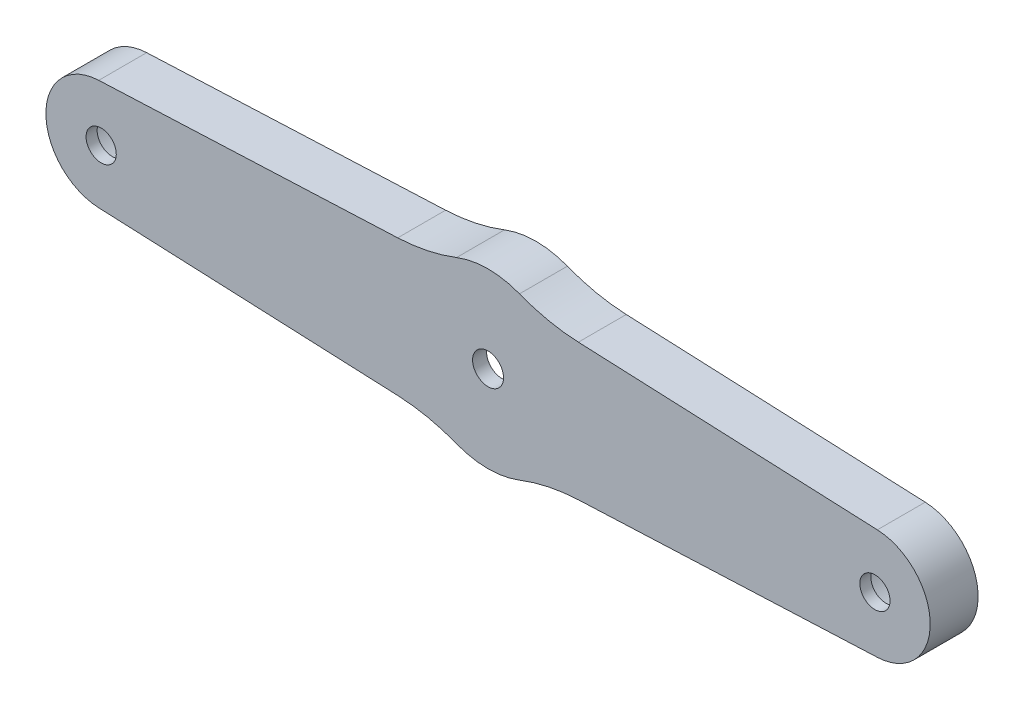
ISO-10303-21;
HEADER;
FILE_DESCRIPTION(('STEP AP214'),'2;1');
FILE_NAME('part.step','',(''),(''),'','','');
FILE_SCHEMA(('AUTOMOTIVE_DESIGN { 1 0 10303 214 1 1 1 1 }'));
ENDSEC;
DATA;
#1=APPLICATION_CONTEXT('core data for automotive mechanical design processes');
#2=APPLICATION_PROTOCOL_DEFINITION('international standard','automotive_design',2000,#1);
#3=PRODUCT_CONTEXT('',#1,'mechanical');
#4=PRODUCT('Part','Part','',(#3));
#5=PRODUCT_RELATED_PRODUCT_CATEGORY('part','',(#4));
#6=PRODUCT_DEFINITION_FORMATION('','',#4);
#7=PRODUCT_DEFINITION_CONTEXT('part definition',#1,'design');
#8=PRODUCT_DEFINITION('design','',#6,#7);
#9=PRODUCT_DEFINITION_SHAPE('','',#8);
#10=(LENGTH_UNIT() NAMED_UNIT(*) SI_UNIT(.MILLI.,.METRE.));
#11=(NAMED_UNIT(*) PLANE_ANGLE_UNIT() SI_UNIT($,.RADIAN.));
#12=(NAMED_UNIT(*) SI_UNIT($,.STERADIAN.) SOLID_ANGLE_UNIT());
#13=UNCERTAINTY_MEASURE_WITH_UNIT(LENGTH_MEASURE(1.E-05),#10,'distance_accuracy_value','');
#14=(GEOMETRIC_REPRESENTATION_CONTEXT(3) GLOBAL_UNCERTAINTY_ASSIGNED_CONTEXT((#13)) GLOBAL_UNIT_ASSIGNED_CONTEXT((#10,
#11,#12)) REPRESENTATION_CONTEXT('',''));
#15=CARTESIAN_POINT('',(0.,0.,0.));
#16=DIRECTION('',(0.,0.,1.));
#17=DIRECTION('',(1.,0.,0.));
#18=AXIS2_PLACEMENT_3D('',#15,#16,#17);
#19=CARTESIAN_POINT('',(0.,29.,52.5));
#20=DIRECTION('',(0.,0.,1.));
#21=DIRECTION('',(1.,0.,0.));
#22=AXIS2_PLACEMENT_3D('',#19,#20,#21);
#23=CYLINDRICAL_SURFACE('',#22,20.);
#24=CARTESIAN_POINT('',(0.,29.,61.7));
#25=DIRECTION('',(0.,0.,1.));
#26=DIRECTION('',(1.,0.,0.));
#27=AXIS2_PLACEMENT_3D('',#24,#25,#26);
#28=CIRCLE('',#27,20.);
#29=CARTESIAN_POINT('',(20.,29.,61.7));
#30=VERTEX_POINT('',#29);
#31=EDGE_CURVE('E206',#30,#30,#28,.F.);
#32=ORIENTED_EDGE('',*,*,#31,.F.);
#33=EDGE_LOOP('',(#32));
#34=FACE_BOUND('',#33,.T.);
#35=CARTESIAN_POINT('',(0.,29.,52.5));
#36=DIRECTION('',(0.,0.,1.));
#37=DIRECTION('',(1.,0.,0.));
#38=AXIS2_PLACEMENT_3D('',#35,#36,#37);
#39=CIRCLE('',#38,20.);
#40=CARTESIAN_POINT('',(20.,29.,52.5));
#41=VERTEX_POINT('',#40);
#42=EDGE_CURVE('E19',#41,#41,#39,.F.);
#43=ORIENTED_EDGE('',*,*,#42,.T.);
#44=EDGE_LOOP('',(#43));
#45=FACE_BOUND('',#44,.T.);
#46=ADVANCED_FACE('F16',(#34,#45),#23,.F.);
#47=CARTESIAN_POINT('',(-105.,29.,52.5));
#48=DIRECTION('',(0.,0.,1.));
#49=DIRECTION('',(1.,0.,0.));
#50=AXIS2_PLACEMENT_3D('',#47,#48,#49);
#51=CYLINDRICAL_SURFACE('',#50,12.);
#52=CARTESIAN_POINT('',(-105.,29.,62.5));
#53=DIRECTION('',(0.,0.,1.));
#54=DIRECTION('',(1.,0.,0.));
#55=AXIS2_PLACEMENT_3D('',#52,#53,#54);
#56=CIRCLE('',#55,12.);
#57=CARTESIAN_POINT('',(-93.,29.,62.5));
#58=VERTEX_POINT('',#57);
#59=EDGE_CURVE('E203',#58,#58,#56,.F.);
#60=ORIENTED_EDGE('',*,*,#59,.F.);
#61=EDGE_LOOP('',(#60));
#62=FACE_BOUND('',#61,.T.);
#63=CARTESIAN_POINT('',(-105.,29.,52.5));
#64=DIRECTION('',(0.,0.,1.));
#65=DIRECTION('',(1.,0.,0.));
#66=AXIS2_PLACEMENT_3D('',#63,#64,#65);
#67=CIRCLE('',#66,12.);
#68=CARTESIAN_POINT('',(-93.,29.,52.5));
#69=VERTEX_POINT('',#68);
#70=EDGE_CURVE('E211',#69,#69,#67,.F.);
#71=ORIENTED_EDGE('',*,*,#70,.T.);
#72=EDGE_LOOP('',(#71));
#73=FACE_BOUND('',#72,.T.);
#74=ADVANCED_FACE('F232',(#62,#73),#51,.F.);
#75=CARTESIAN_POINT('',(105.,29.,52.5));
#76=DIRECTION('',(0.,0.,1.));
#77=DIRECTION('',(1.,0.,0.));
#78=AXIS2_PLACEMENT_3D('',#75,#76,#77);
#79=CYLINDRICAL_SURFACE('',#78,12.);
#80=CARTESIAN_POINT('',(105.,29.,62.5));
#81=DIRECTION('',(0.,0.,1.));
#82=DIRECTION('',(1.,0.,0.));
#83=AXIS2_PLACEMENT_3D('',#80,#81,#82);
#84=CIRCLE('',#83,12.);
#85=CARTESIAN_POINT('',(117.,29.,62.5));
#86=VERTEX_POINT('',#85);
#87=EDGE_CURVE('E114',#86,#86,#84,.F.);
#88=ORIENTED_EDGE('',*,*,#87,.F.);
#89=EDGE_LOOP('',(#88));
#90=FACE_BOUND('',#89,.T.);
#91=CARTESIAN_POINT('',(105.,29.,52.5));
#92=DIRECTION('',(0.,0.,1.));
#93=DIRECTION('',(1.,0.,0.));
#94=AXIS2_PLACEMENT_3D('',#91,#92,#93);
#95=CIRCLE('',#94,12.);
#96=CARTESIAN_POINT('',(117.,29.,52.5));
#97=VERTEX_POINT('',#96);
#98=EDGE_CURVE('E209',#97,#97,#95,.F.);
#99=ORIENTED_EDGE('',*,*,#98,.T.);
#100=EDGE_LOOP('',(#99));
#101=FACE_BOUND('',#100,.T.);
#102=ADVANCED_FACE('F221',(#90,#101),#79,.F.);
#103=CARTESIAN_POINT('',(0.,29.0000000000001,52.5));
#104=DIRECTION('',(0.,0.,1.));
#105=DIRECTION('',(1.,0.,0.));
#106=AXIS2_PLACEMENT_3D('',#103,#104,#105);
#107=PLANE('',#106);
#108=ORIENTED_EDGE('',*,*,#98,.F.);
#109=EDGE_LOOP('',(#108));
#110=FACE_BOUND('',#109,.T.);
#111=ORIENTED_EDGE('',*,*,#70,.F.);
#112=EDGE_LOOP('',(#111));
#113=FACE_BOUND('',#112,.T.);
#114=ORIENTED_EDGE('',*,*,#42,.F.);
#115=EDGE_LOOP('',(#114));
#116=FACE_BOUND('',#115,.T.);
#117=DIRECTION('',(0.999048221581858,0.0436193873653249,0.));
#118=VECTOR('',#117,1.);
#119=CARTESIAN_POINT('',(13.8367845227035,10.0054377762405,52.5));
#120=LINE('',#119,#118);
#121=CARTESIAN_POINT('',(24.5141938105712,10.4716235335688,52.5));
#122=VERTEX_POINT('',#121);
#123=CARTESIAN_POINT('',(105.65429081048,14.014276676272,52.5));
#124=VERTEX_POINT('',#123);
#125=EDGE_CURVE('E108',#122,#124,#120,.T.);
#126=ORIENTED_EDGE('',*,*,#125,.F.);
#127=CARTESIAN_POINT('',(26.6951631788374,-39.4807875455241,52.5));
#128=DIRECTION('',(0.,0.,1.));
#129=DIRECTION('',(1.,0.,0.));
#130=AXIS2_PLACEMENT_3D('',#127,#128,#129);
#131=CIRCLE('',#130,50.);
#132=CARTESIAN_POINT('',(8.5351882272473,7.10478221333597,52.5));
#133=VERTEX_POINT('',#132);
#134=EDGE_CURVE('E127',#122,#133,#131,.T.);
#135=ORIENTED_EDGE('',*,*,#134,.T.);
#136=CARTESIAN_POINT('',(0.,29.,52.5));
#137=DIRECTION('',(0.,0.,1.));
#138=DIRECTION('',(1.,0.,0.));
#139=AXIS2_PLACEMENT_3D('',#136,#137,#138);
#140=CIRCLE('',#139,23.4999999999998);
#141=CARTESIAN_POINT('',(-8.53518822724746,7.10478221333603,52.5));
#142=VERTEX_POINT('',#141);
#143=EDGE_CURVE('E184',#142,#133,#140,.T.);
#144=ORIENTED_EDGE('',*,*,#143,.F.);
#145=CARTESIAN_POINT('',(-26.695163178838,-39.4807875455239,52.5));
#146=DIRECTION('',(0.,0.,1.));
#147=DIRECTION('',(1.,0.,0.));
#148=AXIS2_PLACEMENT_3D('',#145,#146,#147);
#149=CIRCLE('',#148,50.);
#150=CARTESIAN_POINT('',(-24.5141938105718,10.471623533569,52.5));
#151=VERTEX_POINT('',#150);
#152=EDGE_CURVE('E187',#142,#151,#149,.T.);
#153=ORIENTED_EDGE('',*,*,#152,.T.);
#154=DIRECTION('',(0.999048221581858,-0.0436193873653238,0.));
#155=VECTOR('',#154,1.);
#156=CARTESIAN_POINT('',(-105.65429081048,14.0142766762721,52.5));
#157=LINE('',#156,#155);
#158=CARTESIAN_POINT('',(-105.65429081048,14.0142766762721,52.5));
#159=VERTEX_POINT('',#158);
#160=EDGE_CURVE('E132',#159,#151,#157,.T.);
#161=ORIENTED_EDGE('',*,*,#160,.F.);
#162=CARTESIAN_POINT('',(-105.,29.,52.5));
#163=DIRECTION('',(0.,0.,1.));
#164=DIRECTION('',(1.,0.,0.));
#165=AXIS2_PLACEMENT_3D('',#162,#163,#164);
#166=CIRCLE('',#165,15.);
#167=CARTESIAN_POINT('',(-105.65429081048,43.9857233237278,52.5));
#168=VERTEX_POINT('',#167);
#169=EDGE_CURVE('E139',#168,#159,#166,.T.);
#170=ORIENTED_EDGE('',*,*,#169,.F.);
#171=DIRECTION('',(-0.999048221581857,-0.043619387365342,0.));
#172=VECTOR('',#171,1.);
#173=CARTESIAN_POINT('',(-13.8367845227016,47.994562223761,52.5));
#174=LINE('',#173,#172);
#175=CARTESIAN_POINT('',(-24.5141938105673,47.5283764664326,52.5));
#176=VERTEX_POINT('',#175);
#177=EDGE_CURVE('E136',#176,#168,#174,.T.);
#178=ORIENTED_EDGE('',*,*,#177,.F.);
#179=CARTESIAN_POINT('',(-26.6951631788344,97.4807875455255,52.5));
#180=DIRECTION('',(0.,0.,1.));
#181=DIRECTION('',(1.,0.,0.));
#182=AXIS2_PLACEMENT_3D('',#179,#180,#181);
#183=CIRCLE('',#182,50.);
#184=CARTESIAN_POINT('',(-8.53518822724637,50.8952177866646,52.5));
#185=VERTEX_POINT('',#184);
#186=EDGE_CURVE('E192',#176,#185,#183,.T.);
#187=ORIENTED_EDGE('',*,*,#186,.T.);
#188=CARTESIAN_POINT('',(0.,29.,52.5));
#189=DIRECTION('',(0.,0.,1.));
#190=DIRECTION('',(1.,0.,0.));
#191=AXIS2_PLACEMENT_3D('',#188,#189,#190);
#192=CIRCLE('',#191,23.5);
#193=CARTESIAN_POINT('',(8.53518822724646,50.8952177866646,52.5));
#194=VERTEX_POINT('',#193);
#195=EDGE_CURVE('E196',#194,#185,#192,.T.);
#196=ORIENTED_EDGE('',*,*,#195,.F.);
#197=CARTESIAN_POINT('',(26.6951631788346,97.4807875455255,52.5));
#198=DIRECTION('',(0.,0.,1.));
#199=DIRECTION('',(1.,0.,0.));
#200=AXIS2_PLACEMENT_3D('',#197,#198,#199);
#201=CIRCLE('',#200,50.);
#202=CARTESIAN_POINT('',(24.5141938105676,47.5283764664326,52.5));
#203=VERTEX_POINT('',#202);
#204=EDGE_CURVE('E199',#194,#203,#201,.T.);
#205=ORIENTED_EDGE('',*,*,#204,.T.);
#206=DIRECTION('',(-0.999048221581858,0.0436193873653404,0.));
#207=VECTOR('',#206,1.);
#208=CARTESIAN_POINT('',(105.65429081048,43.9857233237279,52.5));
#209=LINE('',#208,#207);
#210=CARTESIAN_POINT('',(105.65429081048,43.9857233237279,52.5));
#211=VERTEX_POINT('',#210);
#212=EDGE_CURVE('E110',#211,#203,#209,.T.);
#213=ORIENTED_EDGE('',*,*,#212,.F.);
#214=CARTESIAN_POINT('',(105.,29.,52.5));
#215=DIRECTION('',(0.,0.,1.));
#216=DIRECTION('',(1.,0.,0.));
#217=AXIS2_PLACEMENT_3D('',#214,#215,#216);
#218=CIRCLE('',#217,15.0000000000001);
#219=EDGE_CURVE('E103',#124,#211,#218,.T.);
#220=ORIENTED_EDGE('',*,*,#219,.F.);
#221=EDGE_LOOP('',(#126,#135,#144,#153,#161,#170,#178,#187,#196,#205,#213,#220));
#222=FACE_BOUND('',#221,.T.);
#223=ADVANCED_FACE('F105',(#110,#113,#116,#222),#107,.F.);
#224=CARTESIAN_POINT('',(0.,29.,61.7));
#225=DIRECTION('',(0.,0.,-1.));
#226=DIRECTION('',(-1.,0.,0.));
#227=AXIS2_PLACEMENT_3D('',#224,#225,#226);
#228=PLANE('',#227);
#229=CARTESIAN_POINT('',(0.,29.,61.7));
#230=DIRECTION('',(0.,0.,-1.));
#231=DIRECTION('',(-1.,0.,0.));
#232=AXIS2_PLACEMENT_3D('',#229,#230,#231);
#233=CIRCLE('',#232,4.2);
#234=CARTESIAN_POINT('',(-4.19999999999998,29.,61.7));
#235=VERTEX_POINT('',#234);
#236=EDGE_CURVE('E123',#235,#235,#233,.F.);
#237=ORIENTED_EDGE('',*,*,#236,.T.);
#238=EDGE_LOOP('',(#237));
#239=FACE_BOUND('',#238,.T.);
#240=ORIENTED_EDGE('',*,*,#31,.T.);
#241=EDGE_LOOP('',(#240));
#242=FACE_BOUND('',#241,.T.);
#243=ADVANCED_FACE('F220',(#239,#242),#228,.T.);
#244=CARTESIAN_POINT('',(-105.,29.,62.5));
#245=DIRECTION('',(0.,0.,-1.));
#246=DIRECTION('',(-1.,0.,0.));
#247=AXIS2_PLACEMENT_3D('',#244,#245,#246);
#248=PLANE('',#247);
#249=CARTESIAN_POINT('',(-105.,29.,62.5));
#250=DIRECTION('',(0.,0.,-1.));
#251=DIRECTION('',(0.,1.,0.));
#252=AXIS2_PLACEMENT_3D('',#249,#250,#251);
#253=CIRCLE('',#252,4.1);
#254=CARTESIAN_POINT('',(-105.,33.1,62.5));
#255=VERTEX_POINT('',#254);
#256=EDGE_CURVE('E177',#255,#255,#253,.F.);
#257=ORIENTED_EDGE('',*,*,#256,.T.);
#258=EDGE_LOOP('',(#257));
#259=FACE_BOUND('',#258,.T.);
#260=ORIENTED_EDGE('',*,*,#59,.T.);
#261=EDGE_LOOP('',(#260));
#262=FACE_BOUND('',#261,.T.);
#263=ADVANCED_FACE('F229',(#259,#262),#248,.T.);
#264=CARTESIAN_POINT('',(105.,29.,62.5));
#265=DIRECTION('',(0.,0.,-1.));
#266=DIRECTION('',(-1.,0.,0.));
#267=AXIS2_PLACEMENT_3D('',#264,#265,#266);
#268=PLANE('',#267);
#269=CARTESIAN_POINT('',(105.,29.,62.5));
#270=DIRECTION('',(0.,0.,-1.));
#271=DIRECTION('',(0.,1.,0.));
#272=AXIS2_PLACEMENT_3D('',#269,#270,#271);
#273=CIRCLE('',#272,4.1);
#274=CARTESIAN_POINT('',(105.,33.1,62.5));
#275=VERTEX_POINT('',#274);
#276=EDGE_CURVE('E174',#275,#275,#273,.F.);
#277=ORIENTED_EDGE('',*,*,#276,.T.);
#278=EDGE_LOOP('',(#277));
#279=FACE_BOUND('',#278,.T.);
#280=ORIENTED_EDGE('',*,*,#87,.T.);
#281=EDGE_LOOP('',(#280));
#282=FACE_BOUND('',#281,.T.);
#283=ADVANCED_FACE('F300',(#279,#282),#268,.T.);
#284=CARTESIAN_POINT('',(105.,29.,52.5));
#285=DIRECTION('',(0.,0.,1.));
#286=DIRECTION('',(1.,0.,0.));
#287=AXIS2_PLACEMENT_3D('',#284,#285,#286);
#288=CYLINDRICAL_SURFACE('',#287,15.0000000000001);
#289=CARTESIAN_POINT('',(105.,29.,65.5));
#290=DIRECTION('',(0.,0.,1.));
#291=DIRECTION('',(1.,0.,0.));
#292=AXIS2_PLACEMENT_3D('',#289,#290,#291);
#293=CIRCLE('',#292,15.0000000000001);
#294=CARTESIAN_POINT('',(105.65429081048,14.014276676272,65.5));
#295=VERTEX_POINT('',#294);
#296=CARTESIAN_POINT('',(105.65429081048,43.9857233237279,65.5));
#297=VERTEX_POINT('',#296);
#298=EDGE_CURVE('E120',#295,#297,#293,.T.);
#299=ORIENTED_EDGE('',*,*,#298,.F.);
#300=DIRECTION('',(0.,0.,1.));
#301=VECTOR('',#300,1.);
#302=CARTESIAN_POINT('',(105.65429081048,14.014276676272,52.5));
#303=LINE('',#302,#301);
#304=EDGE_CURVE('E117',#124,#295,#303,.T.);
#305=ORIENTED_EDGE('',*,*,#304,.F.);
#306=ORIENTED_EDGE('',*,*,#219,.T.);
#307=DIRECTION('',(0.,0.,1.));
#308=VECTOR('',#307,1.);
#309=CARTESIAN_POINT('',(105.65429081048,43.9857233237279,52.5));
#310=LINE('',#309,#308);
#311=EDGE_CURVE('E113',#297,#211,#310,.F.);
#312=ORIENTED_EDGE('',*,*,#311,.F.);
#313=EDGE_LOOP('',(#299,#305,#306,#312));
#314=FACE_BOUND('',#313,.T.);
#315=ADVANCED_FACE('F118',(#314),#288,.T.);
#316=CARTESIAN_POINT('',(105.65429081048,43.9857233237279,52.5));
#317=DIRECTION('',(0.0436193873653404,0.999048221581858,0.));
#318=DIRECTION('',(-0.999048221581858,0.0436193873653404,0.));
#319=AXIS2_PLACEMENT_3D('',#316,#317,#318);
#320=PLANE('',#319);
#321=ORIENTED_EDGE('',*,*,#311,.T.);
#322=ORIENTED_EDGE('',*,*,#212,.T.);
#323=DIRECTION('',(0.,0.,1.));
#324=VECTOR('',#323,1.);
#325=CARTESIAN_POINT('',(24.5141938105676,47.5283764664326,52.5));
#326=LINE('',#325,#324);
#327=CARTESIAN_POINT('',(24.5141938105676,47.5283764664326,65.5));
#328=VERTEX_POINT('',#327);
#329=EDGE_CURVE('E141',#203,#328,#326,.T.);
#330=ORIENTED_EDGE('',*,*,#329,.T.);
#331=DIRECTION('',(-0.999048221581858,0.0436193873653408,0.));
#332=VECTOR('',#331,1.);
#333=CARTESIAN_POINT('',(105.65429081048,43.9857233237279,65.5));
#334=LINE('',#333,#332);
#335=EDGE_CURVE('E172',#297,#328,#334,.T.);
#336=ORIENTED_EDGE('',*,*,#335,.F.);
#337=EDGE_LOOP('',(#321,#322,#330,#336));
#338=FACE_BOUND('',#337,.T.);
#339=ADVANCED_FACE('F293',(#338),#320,.T.);
#340=CARTESIAN_POINT('',(26.6951631788346,97.4807875455255,52.5));
#341=DIRECTION('',(0.,0.,1.));
#342=DIRECTION('',(1.,0.,0.));
#343=AXIS2_PLACEMENT_3D('',#340,#341,#342);
#344=CYLINDRICAL_SURFACE('',#343,50.);
#345=DIRECTION('',(0.,0.,1.));
#346=VECTOR('',#345,1.);
#347=CARTESIAN_POINT('',(8.53518822724646,50.8952177866646,52.5));
#348=LINE('',#347,#346);
#349=CARTESIAN_POINT('',(8.53518822724646,50.8952177866646,65.5));
#350=VERTEX_POINT('',#349);
#351=EDGE_CURVE('E198',#350,#194,#348,.F.);
#352=ORIENTED_EDGE('',*,*,#351,.F.);
#353=CARTESIAN_POINT('',(26.6951631788346,97.4807875455255,65.5));
#354=DIRECTION('',(0.,0.,1.));
#355=DIRECTION('',(1.,0.,0.));
#356=AXIS2_PLACEMENT_3D('',#353,#354,#355);
#357=CIRCLE('',#356,50.);
#358=EDGE_CURVE('E169',#328,#350,#357,.F.);
#359=ORIENTED_EDGE('',*,*,#358,.F.);
#360=ORIENTED_EDGE('',*,*,#329,.F.);
#361=ORIENTED_EDGE('',*,*,#204,.F.);
#362=EDGE_LOOP('',(#352,#359,#360,#361));
#363=FACE_BOUND('',#362,.T.);
#364=ADVANCED_FACE('F289',(#363),#344,.F.);
#365=CARTESIAN_POINT('',(0.,29.,52.5));
#366=DIRECTION('',(0.,0.,1.));
#367=DIRECTION('',(1.,0.,0.));
#368=AXIS2_PLACEMENT_3D('',#365,#366,#367);
#369=CYLINDRICAL_SURFACE('',#368,23.5);
#370=ORIENTED_EDGE('',*,*,#351,.T.);
#371=ORIENTED_EDGE('',*,*,#195,.T.);
#372=DIRECTION('',(0.,0.,1.));
#373=VECTOR('',#372,1.);
#374=CARTESIAN_POINT('',(-8.53518822724638,50.8952177866646,52.5));
#375=LINE('',#374,#373);
#376=CARTESIAN_POINT('',(-8.53518822724636,50.8952177866646,65.5));
#377=VERTEX_POINT('',#376);
#378=EDGE_CURVE('E195',#185,#377,#375,.T.);
#379=ORIENTED_EDGE('',*,*,#378,.T.);
#380=CARTESIAN_POINT('',(0.,29.,65.5));
#381=DIRECTION('',(0.,0.,1.));
#382=DIRECTION('',(1.,0.,0.));
#383=AXIS2_PLACEMENT_3D('',#380,#381,#382);
#384=CIRCLE('',#383,23.5);
#385=EDGE_CURVE('E166',#350,#377,#384,.T.);
#386=ORIENTED_EDGE('',*,*,#385,.F.);
#387=EDGE_LOOP('',(#370,#371,#379,#386));
#388=FACE_BOUND('',#387,.T.);
#389=ADVANCED_FACE('F285',(#388),#369,.T.);
#390=CARTESIAN_POINT('',(-26.6951631788344,97.4807875455255,52.5));
#391=DIRECTION('',(0.,0.,1.));
#392=DIRECTION('',(1.,0.,0.));
#393=AXIS2_PLACEMENT_3D('',#390,#391,#392);
#394=CYLINDRICAL_SURFACE('',#393,50.);
#395=DIRECTION('',(0.,0.,1.));
#396=VECTOR('',#395,1.);
#397=CARTESIAN_POINT('',(-24.5141938105673,47.5283764664326,52.5));
#398=LINE('',#397,#396);
#399=CARTESIAN_POINT('',(-24.5141938105673,47.5283764664327,65.5));
#400=VERTEX_POINT('',#399);
#401=EDGE_CURVE('E140',#400,#176,#398,.F.);
#402=ORIENTED_EDGE('',*,*,#401,.F.);
#403=CARTESIAN_POINT('',(-26.6951631788344,97.4807875455255,65.5));
#404=DIRECTION('',(0.,0.,1.));
#405=DIRECTION('',(1.,0.,0.));
#406=AXIS2_PLACEMENT_3D('',#403,#404,#405);
#407=CIRCLE('',#406,50.);
#408=EDGE_CURVE('E163',#377,#400,#407,.F.);
#409=ORIENTED_EDGE('',*,*,#408,.F.);
#410=ORIENTED_EDGE('',*,*,#378,.F.);
#411=ORIENTED_EDGE('',*,*,#186,.F.);
#412=EDGE_LOOP('',(#402,#409,#410,#411));
#413=FACE_BOUND('',#412,.T.);
#414=ADVANCED_FACE('F281',(#413),#394,.F.);
#415=CARTESIAN_POINT('',(-13.8367845227016,47.994562223761,52.5));
#416=DIRECTION('',(-0.043619387365342,0.999048221581857,0.));
#417=DIRECTION('',(-0.999048221581857,-0.043619387365342,0.));
#418=AXIS2_PLACEMENT_3D('',#415,#416,#417);
#419=PLANE('',#418);
#420=DIRECTION('',(0.,0.,1.));
#421=VECTOR('',#420,1.);
#422=CARTESIAN_POINT('',(-105.65429081048,43.9857233237279,52.5));
#423=LINE('',#422,#421);
#424=CARTESIAN_POINT('',(-105.65429081048,43.9857233237279,65.5));
#425=VERTEX_POINT('',#424);
#426=EDGE_CURVE('E191',#425,#168,#423,.F.);
#427=ORIENTED_EDGE('',*,*,#426,.F.);
#428=DIRECTION('',(-0.999048221581858,-0.0436193873653418,0.));
#429=VECTOR('',#428,1.);
#430=CARTESIAN_POINT('',(-24.5141938105673,47.5283764664327,65.5));
#431=LINE('',#430,#429);
#432=EDGE_CURVE('E162',#400,#425,#431,.T.);
#433=ORIENTED_EDGE('',*,*,#432,.F.);
#434=ORIENTED_EDGE('',*,*,#401,.T.);
#435=ORIENTED_EDGE('',*,*,#177,.T.);
#436=EDGE_LOOP('',(#427,#433,#434,#435));
#437=FACE_BOUND('',#436,.T.);
#438=ADVANCED_FACE('F277',(#437),#419,.T.);
#439=CARTESIAN_POINT('',(-105.,29.,52.5));
#440=DIRECTION('',(0.,0.,1.));
#441=DIRECTION('',(1.,0.,0.));
#442=AXIS2_PLACEMENT_3D('',#439,#440,#441);
#443=CYLINDRICAL_SURFACE('',#442,15.);
#444=CARTESIAN_POINT('',(-105.,29.,65.5));
#445=DIRECTION('',(0.,0.,1.));
#446=DIRECTION('',(1.,0.,0.));
#447=AXIS2_PLACEMENT_3D('',#444,#445,#446);
#448=CIRCLE('',#447,15.);
#449=CARTESIAN_POINT('',(-105.65429081048,14.0142766762721,65.5));
#450=VERTEX_POINT('',#449);
#451=EDGE_CURVE('E159',#425,#450,#448,.T.);
#452=ORIENTED_EDGE('',*,*,#451,.F.);
#453=ORIENTED_EDGE('',*,*,#426,.T.);
#454=ORIENTED_EDGE('',*,*,#169,.T.);
#455=DIRECTION('',(0.,0.,1.));
#456=VECTOR('',#455,1.);
#457=CARTESIAN_POINT('',(-105.65429081048,14.0142766762721,52.5));
#458=LINE('',#457,#456);
#459=EDGE_CURVE('E135',#450,#159,#458,.F.);
#460=ORIENTED_EDGE('',*,*,#459,.F.);
#461=EDGE_LOOP('',(#452,#453,#454,#460));
#462=FACE_BOUND('',#461,.T.);
#463=ADVANCED_FACE('F273',(#462),#443,.T.);
#464=CARTESIAN_POINT('',(-105.65429081048,14.0142766762721,52.5));
#465=DIRECTION('',(-0.0436193873653238,-0.999048221581858,0.));
#466=DIRECTION('',(0.999048221581858,-0.0436193873653238,0.));
#467=AXIS2_PLACEMENT_3D('',#464,#465,#466);
#468=PLANE('',#467);
#469=ORIENTED_EDGE('',*,*,#459,.T.);
#470=ORIENTED_EDGE('',*,*,#160,.T.);
#471=DIRECTION('',(0.,0.,1.));
#472=VECTOR('',#471,1.);
#473=CARTESIAN_POINT('',(-24.5141938105718,10.471623533569,52.5));
#474=LINE('',#473,#472);
#475=CARTESIAN_POINT('',(-24.5141938105718,10.471623533569,65.5));
#476=VERTEX_POINT('',#475);
#477=EDGE_CURVE('E134',#151,#476,#474,.T.);
#478=ORIENTED_EDGE('',*,*,#477,.T.);
#479=DIRECTION('',(0.999048221581858,-0.0436193873653234,0.));
#480=VECTOR('',#479,1.);
#481=CARTESIAN_POINT('',(-105.65429081048,14.0142766762721,65.5));
#482=LINE('',#481,#480);
#483=EDGE_CURVE('E158',#450,#476,#482,.T.);
#484=ORIENTED_EDGE('',*,*,#483,.F.);
#485=EDGE_LOOP('',(#469,#470,#478,#484));
#486=FACE_BOUND('',#485,.T.);
#487=ADVANCED_FACE('F269',(#486),#468,.T.);
#488=CARTESIAN_POINT('',(-26.695163178838,-39.4807875455239,52.5));
#489=DIRECTION('',(0.,0.,1.));
#490=DIRECTION('',(1.,0.,0.));
#491=AXIS2_PLACEMENT_3D('',#488,#489,#490);
#492=CYLINDRICAL_SURFACE('',#491,50.);
#493=DIRECTION('',(0.,0.,1.));
#494=VECTOR('',#493,1.);
#495=CARTESIAN_POINT('',(-8.53518822724747,7.10478221333603,52.5));
#496=LINE('',#495,#494);
#497=CARTESIAN_POINT('',(-8.53518822724747,7.10478221333602,65.5));
#498=VERTEX_POINT('',#497);
#499=EDGE_CURVE('E186',#498,#142,#496,.F.);
#500=ORIENTED_EDGE('',*,*,#499,.F.);
#501=CARTESIAN_POINT('',(-26.695163178838,-39.4807875455239,65.5));
#502=DIRECTION('',(0.,0.,1.));
#503=DIRECTION('',(1.,0.,0.));
#504=AXIS2_PLACEMENT_3D('',#501,#502,#503);
#505=CIRCLE('',#504,50.);
#506=EDGE_CURVE('E155',#476,#498,#505,.F.);
#507=ORIENTED_EDGE('',*,*,#506,.F.);
#508=ORIENTED_EDGE('',*,*,#477,.F.);
#509=ORIENTED_EDGE('',*,*,#152,.F.);
#510=EDGE_LOOP('',(#500,#507,#508,#509));
#511=FACE_BOUND('',#510,.T.);
#512=ADVANCED_FACE('F265',(#511),#492,.F.);
#513=CARTESIAN_POINT('',(0.,29.,52.5));
#514=DIRECTION('',(0.,0.,1.));
#515=DIRECTION('',(1.,0.,0.));
#516=AXIS2_PLACEMENT_3D('',#513,#514,#515);
#517=CYLINDRICAL_SURFACE('',#516,23.4999999999998);
#518=DIRECTION('',(0.,0.,1.));
#519=VECTOR('',#518,1.);
#520=CARTESIAN_POINT('',(8.53518822724729,7.104782213336,52.5));
#521=LINE('',#520,#519);
#522=CARTESIAN_POINT('',(8.53518822724729,7.104782213336,65.5));
#523=VERTEX_POINT('',#522);
#524=EDGE_CURVE('E183',#133,#523,#521,.T.);
#525=ORIENTED_EDGE('',*,*,#524,.T.);
#526=CARTESIAN_POINT('',(0.,29.,65.5));
#527=DIRECTION('',(0.,0.,1.));
#528=DIRECTION('',(1.,0.,0.));
#529=AXIS2_PLACEMENT_3D('',#526,#527,#528);
#530=CIRCLE('',#529,23.4999999999998);
#531=EDGE_CURVE('E152',#498,#523,#530,.T.);
#532=ORIENTED_EDGE('',*,*,#531,.F.);
#533=ORIENTED_EDGE('',*,*,#499,.T.);
#534=ORIENTED_EDGE('',*,*,#143,.T.);
#535=EDGE_LOOP('',(#525,#532,#533,#534));
#536=FACE_BOUND('',#535,.T.);
#537=ADVANCED_FACE('F262',(#536),#517,.T.);
#538=CARTESIAN_POINT('',(26.6951631788374,-39.4807875455241,52.5));
#539=DIRECTION('',(0.,0.,1.));
#540=DIRECTION('',(1.,0.,0.));
#541=AXIS2_PLACEMENT_3D('',#538,#539,#540);
#542=CYLINDRICAL_SURFACE('',#541,50.);
#543=DIRECTION('',(0.,0.,1.));
#544=VECTOR('',#543,1.);
#545=CARTESIAN_POINT('',(24.5141938105712,10.4716235335688,52.5));
#546=LINE('',#545,#544);
#547=CARTESIAN_POINT('',(24.5141938105712,10.4716235335688,65.5));
#548=VERTEX_POINT('',#547);
#549=EDGE_CURVE('E34',#548,#122,#546,.F.);
#550=ORIENTED_EDGE('',*,*,#549,.F.);
#551=CARTESIAN_POINT('',(26.6951631788374,-39.4807875455241,65.5));
#552=DIRECTION('',(0.,0.,1.));
#553=DIRECTION('',(1.,0.,0.));
#554=AXIS2_PLACEMENT_3D('',#551,#552,#553);
#555=CIRCLE('',#554,50.);
#556=EDGE_CURVE('E149',#523,#548,#555,.F.);
#557=ORIENTED_EDGE('',*,*,#556,.F.);
#558=ORIENTED_EDGE('',*,*,#524,.F.);
#559=ORIENTED_EDGE('',*,*,#134,.F.);
#560=EDGE_LOOP('',(#550,#557,#558,#559));
#561=FACE_BOUND('',#560,.T.);
#562=ADVANCED_FACE('F259',(#561),#542,.F.);
#563=CARTESIAN_POINT('',(13.8367845227035,10.0054377762405,52.5));
#564=DIRECTION('',(0.0436193873653249,-0.999048221581858,0.));
#565=DIRECTION('',(0.999048221581858,0.0436193873653249,0.));
#566=AXIS2_PLACEMENT_3D('',#563,#564,#565);
#567=PLANE('',#566);
#568=ORIENTED_EDGE('',*,*,#304,.T.);
#569=DIRECTION('',(0.999048221581858,0.0436193873653243,0.));
#570=VECTOR('',#569,1.);
#571=CARTESIAN_POINT('',(24.5141938105712,10.4716235335688,65.5));
#572=LINE('',#571,#570);
#573=EDGE_CURVE('E148',#548,#295,#572,.T.);
#574=ORIENTED_EDGE('',*,*,#573,.F.);
#575=ORIENTED_EDGE('',*,*,#549,.T.);
#576=ORIENTED_EDGE('',*,*,#125,.T.);
#577=EDGE_LOOP('',(#568,#574,#575,#576));
#578=FACE_BOUND('',#577,.T.);
#579=ADVANCED_FACE('F125',(#578),#567,.T.);
#580=CARTESIAN_POINT('',(0.,29.,63.287));
#581=DIRECTION('',(0.,0.,-1.));
#582=DIRECTION('',(-1.,0.,0.));
#583=AXIS2_PLACEMENT_3D('',#580,#581,#582);
#584=CYLINDRICAL_SURFACE('',#583,4.2);
#585=ORIENTED_EDGE('',*,*,#236,.F.);
#586=EDGE_LOOP('',(#585));
#587=FACE_BOUND('',#586,.T.);
#588=CARTESIAN_POINT('',(0.,29.,65.5));
#589=DIRECTION('',(0.,0.,-1.));
#590=DIRECTION('',(-1.,0.,0.));
#591=AXIS2_PLACEMENT_3D('',#588,#589,#590);
#592=CIRCLE('',#591,4.2);
#593=CARTESIAN_POINT('',(-4.19999999999998,29.,65.5));
#594=VERTEX_POINT('',#593);
#595=EDGE_CURVE('E145',#594,#594,#592,.T.);
#596=ORIENTED_EDGE('',*,*,#595,.F.);
#597=EDGE_LOOP('',(#596));
#598=FACE_BOUND('',#597,.T.);
#599=ADVANCED_FACE('F252',(#587,#598),#584,.F.);
#600=CARTESIAN_POINT('',(-105.,29.,75.495));
#601=DIRECTION('',(0.,0.,-1.));
#602=DIRECTION('',(0.,1.,0.));
#603=AXIS2_PLACEMENT_3D('',#600,#601,#602);
#604=CYLINDRICAL_SURFACE('',#603,4.1);
#605=ORIENTED_EDGE('',*,*,#256,.F.);
#606=EDGE_LOOP('',(#605));
#607=FACE_BOUND('',#606,.T.);
#608=CARTESIAN_POINT('',(-105.,29.,65.5));
#609=DIRECTION('',(0.,0.,-1.));
#610=DIRECTION('',(0.,1.,0.));
#611=AXIS2_PLACEMENT_3D('',#608,#609,#610);
#612=CIRCLE('',#611,4.1);
#613=CARTESIAN_POINT('',(-105.,33.1,65.5));
#614=VERTEX_POINT('',#613);
#615=EDGE_CURVE('E25',#614,#614,#612,.T.);
#616=ORIENTED_EDGE('',*,*,#615,.F.);
#617=EDGE_LOOP('',(#616));
#618=FACE_BOUND('',#617,.T.);
#619=ADVANCED_FACE('F245',(#607,#618),#604,.F.);
#620=CARTESIAN_POINT('',(105.,29.,75.495));
#621=DIRECTION('',(0.,0.,-1.));
#622=DIRECTION('',(0.,1.,0.));
#623=AXIS2_PLACEMENT_3D('',#620,#621,#622);
#624=CYLINDRICAL_SURFACE('',#623,4.1);
#625=ORIENTED_EDGE('',*,*,#276,.F.);
#626=EDGE_LOOP('',(#625));
#627=FACE_BOUND('',#626,.T.);
#628=CARTESIAN_POINT('',(105.,29.,65.5));
#629=DIRECTION('',(0.,0.,-1.));
#630=DIRECTION('',(0.,1.,0.));
#631=AXIS2_PLACEMENT_3D('',#628,#629,#630);
#632=CIRCLE('',#631,4.1);
#633=CARTESIAN_POINT('',(105.,33.1,65.5));
#634=VERTEX_POINT('',#633);
#635=EDGE_CURVE('E11',#634,#634,#632,.T.);
#636=ORIENTED_EDGE('',*,*,#635,.F.);
#637=EDGE_LOOP('',(#636));
#638=FACE_BOUND('',#637,.T.);
#639=ADVANCED_FACE('F239',(#627,#638),#624,.F.);
#640=CARTESIAN_POINT('',(0.,29.0000000000001,65.5));
#641=DIRECTION('',(0.,0.,1.));
#642=DIRECTION('',(1.,0.,0.));
#643=AXIS2_PLACEMENT_3D('',#640,#641,#642);
#644=PLANE('',#643);
#645=ORIENTED_EDGE('',*,*,#635,.T.);
#646=EDGE_LOOP('',(#645));
#647=FACE_BOUND('',#646,.T.);
#648=ORIENTED_EDGE('',*,*,#615,.T.);
#649=EDGE_LOOP('',(#648));
#650=FACE_BOUND('',#649,.T.);
#651=ORIENTED_EDGE('',*,*,#595,.T.);
#652=EDGE_LOOP('',(#651));
#653=FACE_BOUND('',#652,.T.);
#654=ORIENTED_EDGE('',*,*,#556,.T.);
#655=ORIENTED_EDGE('',*,*,#573,.T.);
#656=ORIENTED_EDGE('',*,*,#298,.T.);
#657=ORIENTED_EDGE('',*,*,#335,.T.);
#658=ORIENTED_EDGE('',*,*,#358,.T.);
#659=ORIENTED_EDGE('',*,*,#385,.T.);
#660=ORIENTED_EDGE('',*,*,#408,.T.);
#661=ORIENTED_EDGE('',*,*,#432,.T.);
#662=ORIENTED_EDGE('',*,*,#451,.T.);
#663=ORIENTED_EDGE('',*,*,#483,.T.);
#664=ORIENTED_EDGE('',*,*,#506,.T.);
#665=ORIENTED_EDGE('',*,*,#531,.T.);
#666=EDGE_LOOP('',(#654,#655,#656,#657,#658,#659,#660,#661,#662,#663,#664,#665));
#667=FACE_BOUND('',#666,.T.);
#668=ADVANCED_FACE('F237',(#647,#650,#653,#667),#644,.T.);
#669=CLOSED_SHELL('',(#46,#74,#102,#223,#243,#263,#283,#315,#339,#364,#389,#414,#438,#463,#487,
#512,#537,#562,#579,#599,#619,#639,#668));
#670=MANIFOLD_SOLID_BREP('B1',#669);
#671=ADVANCED_BREP_SHAPE_REPRESENTATION('',(#18,#670),#14);
#672=SHAPE_DEFINITION_REPRESENTATION(#9,#671);
ENDSEC;
END-ISO-10303-21;
